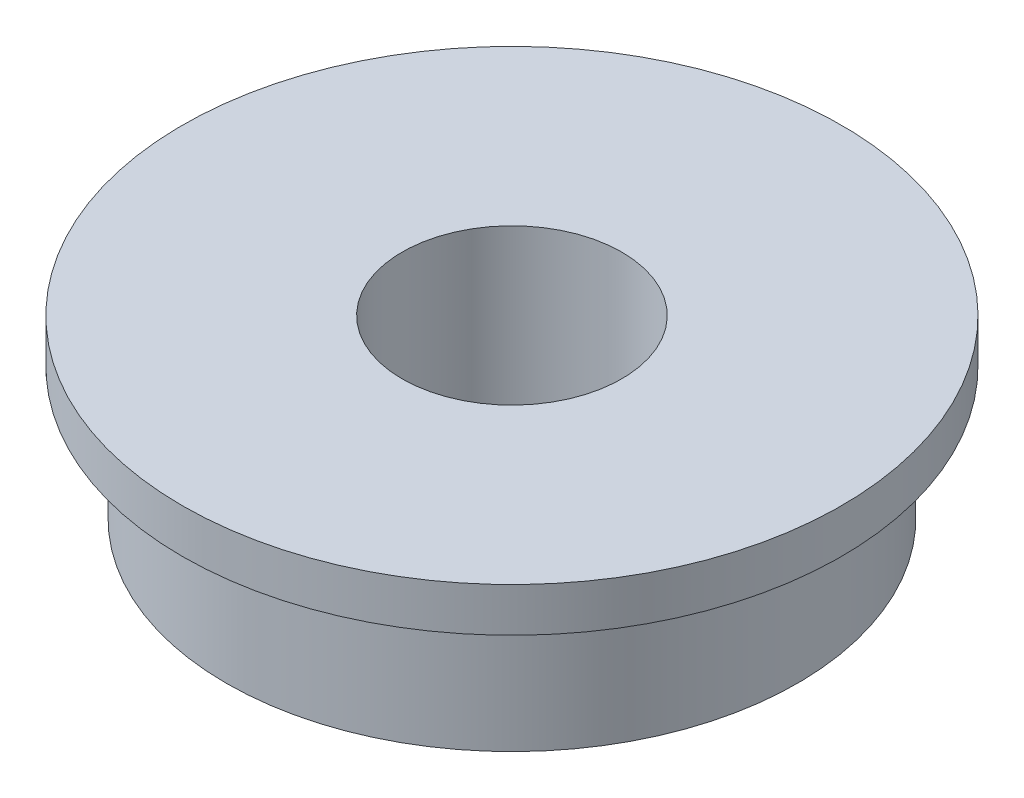
ISO-10303-21;
HEADER;
FILE_DESCRIPTION(('STEP AP214'),'2;1');
FILE_NAME('part.step','',(''),(''),'','','');
FILE_SCHEMA(('AUTOMOTIVE_DESIGN { 1 0 10303 214 1 1 1 1 }'));
ENDSEC;
DATA;
#1=APPLICATION_CONTEXT('core data for automotive mechanical design processes');
#2=APPLICATION_PROTOCOL_DEFINITION('international standard','automotive_design',2000,#1);
#3=PRODUCT_CONTEXT('',#1,'mechanical');
#4=PRODUCT('Part','Part','',(#3));
#5=PRODUCT_RELATED_PRODUCT_CATEGORY('part','',(#4));
#6=PRODUCT_DEFINITION_FORMATION('','',#4);
#7=PRODUCT_DEFINITION_CONTEXT('part definition',#1,'design');
#8=PRODUCT_DEFINITION('design','',#6,#7);
#9=PRODUCT_DEFINITION_SHAPE('','',#8);
#10=(LENGTH_UNIT() NAMED_UNIT(*) SI_UNIT(.MILLI.,.METRE.));
#11=(NAMED_UNIT(*) PLANE_ANGLE_UNIT() SI_UNIT($,.RADIAN.));
#12=(NAMED_UNIT(*) SI_UNIT($,.STERADIAN.) SOLID_ANGLE_UNIT());
#13=UNCERTAINTY_MEASURE_WITH_UNIT(LENGTH_MEASURE(1.E-05),#10,'distance_accuracy_value','');
#14=(GEOMETRIC_REPRESENTATION_CONTEXT(3) GLOBAL_UNCERTAINTY_ASSIGNED_CONTEXT((#13)) GLOBAL_UNIT_ASSIGNED_CONTEXT((#10,
#11,#12)) REPRESENTATION_CONTEXT('',''));
#15=CARTESIAN_POINT('',(0.,0.,0.));
#16=DIRECTION('',(0.,0.,1.));
#17=DIRECTION('',(1.,0.,0.));
#18=AXIS2_PLACEMENT_3D('',#15,#16,#17);
#19=CARTESIAN_POINT('',(0.,2.,0.));
#20=DIRECTION('',(0.,-1.,0.));
#21=DIRECTION('',(0.,0.,-1.));
#22=AXIS2_PLACEMENT_3D('',#19,#20,#21);
#23=CYLINDRICAL_SURFACE('',#22,6.5);
#24=CARTESIAN_POINT('',(0.,-2.,0.));
#25=DIRECTION('',(0.,1.,0.));
#26=DIRECTION('',(0.,0.,1.));
#27=AXIS2_PLACEMENT_3D('',#24,#25,#26);
#28=CIRCLE('',#27,6.5);
#29=CARTESIAN_POINT('',(0.,-2.,6.5));
#30=VERTEX_POINT('',#29);
#31=EDGE_CURVE('E43',#30,#30,#28,.T.);
#32=ORIENTED_EDGE('',*,*,#31,.T.);
#33=EDGE_LOOP('',(#32));
#34=FACE_BOUND('',#33,.T.);
#35=CARTESIAN_POINT('',(0.,1.,0.));
#36=DIRECTION('',(0.,1.,0.));
#37=DIRECTION('',(0.,0.,1.));
#38=AXIS2_PLACEMENT_3D('',#35,#36,#37);
#39=CIRCLE('',#38,6.5);
#40=CARTESIAN_POINT('',(0.,1.,6.5));
#41=VERTEX_POINT('',#40);
#42=EDGE_CURVE('E10',#41,#41,#39,.T.);
#43=ORIENTED_EDGE('',*,*,#42,.F.);
#44=EDGE_LOOP('',(#43));
#45=FACE_BOUND('',#44,.T.);
#46=ADVANCED_FACE('F37',(#34,#45),#23,.T.);
#47=CARTESIAN_POINT('',(0.,2.,0.));
#48=DIRECTION('',(0.,1.,0.));
#49=DIRECTION('',(0.,0.,1.));
#50=AXIS2_PLACEMENT_3D('',#47,#48,#49);
#51=PLANE('',#50);
#52=CARTESIAN_POINT('',(0.,2.,0.));
#53=DIRECTION('',(0.,1.,0.));
#54=DIRECTION('',(0.,0.,1.));
#55=AXIS2_PLACEMENT_3D('',#52,#53,#54);
#56=CIRCLE('',#55,2.5);
#57=CARTESIAN_POINT('',(0.,2.,2.5));
#58=VERTEX_POINT('',#57);
#59=EDGE_CURVE('E47',#58,#58,#56,.T.);
#60=ORIENTED_EDGE('',*,*,#59,.F.);
#61=EDGE_LOOP('',(#60));
#62=FACE_BOUND('',#61,.T.);
#63=CARTESIAN_POINT('',(0.,2.,0.));
#64=DIRECTION('',(0.,1.,0.));
#65=DIRECTION('',(0.,0.,1.));
#66=AXIS2_PLACEMENT_3D('',#63,#64,#65);
#67=CIRCLE('',#66,7.5);
#68=CARTESIAN_POINT('',(0.,2.,7.5));
#69=VERTEX_POINT('',#68);
#70=EDGE_CURVE('E57',#69,#69,#67,.T.);
#71=ORIENTED_EDGE('',*,*,#70,.T.);
#72=EDGE_LOOP('',(#71));
#73=FACE_BOUND('',#72,.T.);
#74=ADVANCED_FACE('F75',(#62,#73),#51,.T.);
#75=CARTESIAN_POINT('',(0.,-2.,0.));
#76=DIRECTION('',(0.,1.,0.));
#77=DIRECTION('',(0.,0.,1.));
#78=AXIS2_PLACEMENT_3D('',#75,#76,#77);
#79=PLANE('',#78);
#80=ORIENTED_EDGE('',*,*,#31,.F.);
#81=EDGE_LOOP('',(#80));
#82=FACE_BOUND('',#81,.T.);
#83=CARTESIAN_POINT('',(0.,-2.,0.));
#84=DIRECTION('',(0.,1.,0.));
#85=DIRECTION('',(0.,0.,1.));
#86=AXIS2_PLACEMENT_3D('',#83,#84,#85);
#87=CIRCLE('',#86,2.5);
#88=CARTESIAN_POINT('',(0.,-2.,2.5));
#89=VERTEX_POINT('',#88);
#90=EDGE_CURVE('E51',#89,#89,#87,.T.);
#91=ORIENTED_EDGE('',*,*,#90,.T.);
#92=EDGE_LOOP('',(#91));
#93=FACE_BOUND('',#92,.T.);
#94=ADVANCED_FACE('F79',(#82,#93),#79,.F.);
#95=CARTESIAN_POINT('',(0.,2.,0.));
#96=DIRECTION('',(0.,-1.,0.));
#97=DIRECTION('',(0.,0.,-1.));
#98=AXIS2_PLACEMENT_3D('',#95,#96,#97);
#99=CYLINDRICAL_SURFACE('',#98,2.5);
#100=ORIENTED_EDGE('',*,*,#59,.T.);
#101=EDGE_LOOP('',(#100));
#102=FACE_BOUND('',#101,.T.);
#103=ORIENTED_EDGE('',*,*,#90,.F.);
#104=EDGE_LOOP('',(#103));
#105=FACE_BOUND('',#104,.T.);
#106=ADVANCED_FACE('F72',(#102,#105),#99,.F.);
#107=CARTESIAN_POINT('',(0.,1.,0.));
#108=DIRECTION('',(0.,1.,0.));
#109=DIRECTION('',(0.,0.,1.));
#110=AXIS2_PLACEMENT_3D('',#107,#108,#109);
#111=CYLINDRICAL_SURFACE('',#110,7.5);
#112=CARTESIAN_POINT('',(0.,1.,0.));
#113=DIRECTION('',(0.,1.,0.));
#114=DIRECTION('',(0.,0.,1.));
#115=AXIS2_PLACEMENT_3D('',#112,#113,#114);
#116=CIRCLE('',#115,7.5);
#117=CARTESIAN_POINT('',(0.,1.,7.5));
#118=VERTEX_POINT('',#117);
#119=EDGE_CURVE('E55',#118,#118,#116,.T.);
#120=ORIENTED_EDGE('',*,*,#119,.T.);
#121=EDGE_LOOP('',(#120));
#122=FACE_BOUND('',#121,.T.);
#123=ORIENTED_EDGE('',*,*,#70,.F.);
#124=EDGE_LOOP('',(#123));
#125=FACE_BOUND('',#124,.T.);
#126=ADVANCED_FACE('F63',(#122,#125),#111,.T.);
#127=CARTESIAN_POINT('',(0.,1.,0.));
#128=DIRECTION('',(0.,1.,0.));
#129=DIRECTION('',(0.,0.,1.));
#130=AXIS2_PLACEMENT_3D('',#127,#128,#129);
#131=PLANE('',#130);
#132=ORIENTED_EDGE('',*,*,#42,.T.);
#133=EDGE_LOOP('',(#132));
#134=FACE_BOUND('',#133,.T.);
#135=ORIENTED_EDGE('',*,*,#119,.F.);
#136=EDGE_LOOP('',(#135));
#137=FACE_BOUND('',#136,.T.);
#138=ADVANCED_FACE('F66',(#134,#137),#131,.F.);
#139=CLOSED_SHELL('',(#46,#74,#94,#106,#126,#138));
#140=MANIFOLD_SOLID_BREP('B2',#139);
#141=ADVANCED_BREP_SHAPE_REPRESENTATION('',(#18,#140),#14);
#142=SHAPE_DEFINITION_REPRESENTATION(#9,#141);
ENDSEC;
END-ISO-10303-21;
